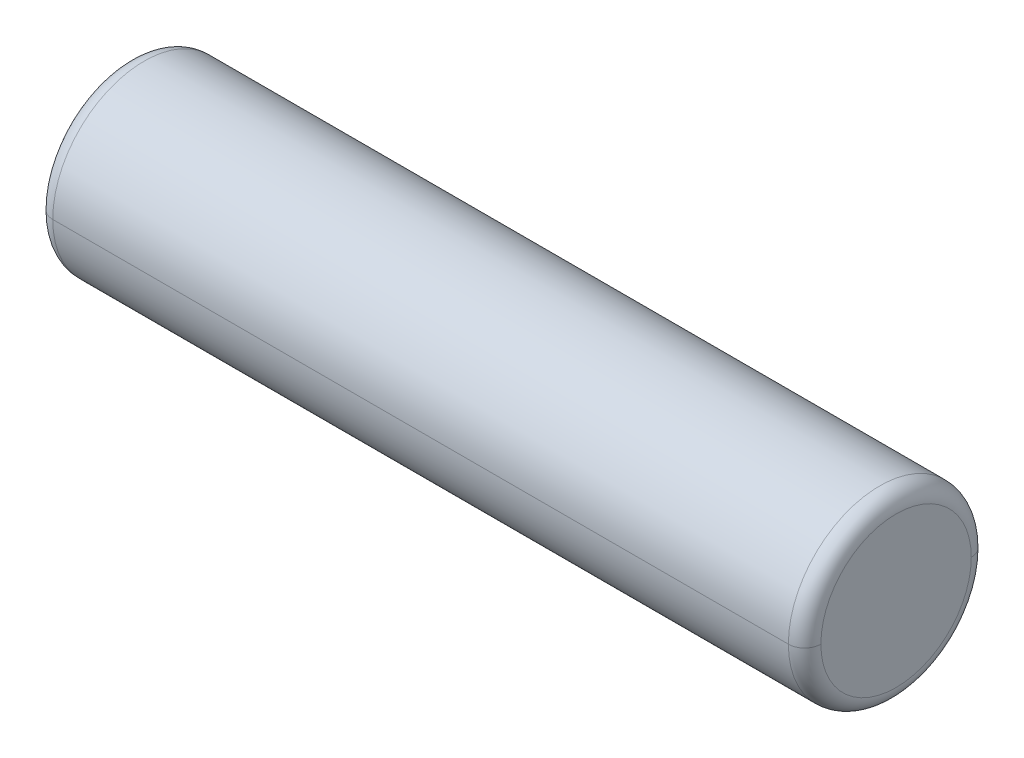
ISO-10303-21;
HEADER;
FILE_DESCRIPTION(('STEP AP214'),'2;1');
FILE_NAME('part.step','',(''),(''),'','','');
FILE_SCHEMA(('AUTOMOTIVE_DESIGN { 1 0 10303 214 1 1 1 1 }'));
ENDSEC;
DATA;
#1=APPLICATION_CONTEXT('core data for automotive mechanical design processes');
#2=APPLICATION_PROTOCOL_DEFINITION('international standard','automotive_design',2000,#1);
#3=PRODUCT_CONTEXT('',#1,'mechanical');
#4=PRODUCT('Part','Part','',(#3));
#5=PRODUCT_RELATED_PRODUCT_CATEGORY('part','',(#4));
#6=PRODUCT_DEFINITION_FORMATION('','',#4);
#7=PRODUCT_DEFINITION_CONTEXT('part definition',#1,'design');
#8=PRODUCT_DEFINITION('design','',#6,#7);
#9=PRODUCT_DEFINITION_SHAPE('','',#8);
#10=(LENGTH_UNIT() NAMED_UNIT(*) SI_UNIT(.MILLI.,.METRE.));
#11=(NAMED_UNIT(*) PLANE_ANGLE_UNIT() SI_UNIT($,.RADIAN.));
#12=(NAMED_UNIT(*) SI_UNIT($,.STERADIAN.) SOLID_ANGLE_UNIT());
#13=UNCERTAINTY_MEASURE_WITH_UNIT(LENGTH_MEASURE(1.E-05),#10,'distance_accuracy_value','');
#14=(GEOMETRIC_REPRESENTATION_CONTEXT(3) GLOBAL_UNCERTAINTY_ASSIGNED_CONTEXT((#13)) GLOBAL_UNIT_ASSIGNED_CONTEXT((#10,
#11,#12)) REPRESENTATION_CONTEXT('',''));
#15=CARTESIAN_POINT('',(0.,0.,0.));
#16=DIRECTION('',(0.,0.,1.));
#17=DIRECTION('',(1.,0.,0.));
#18=AXIS2_PLACEMENT_3D('',#15,#16,#17);
#19=CARTESIAN_POINT('',(8.01666666666676,6.75,0.));
#20=DIRECTION('',(1.,0.,0.));
#21=DIRECTION('',(0.,1.,0.));
#22=AXIS2_PLACEMENT_3D('',#19,#20,#21);
#23=TOROIDAL_SURFACE('',#22,0.6166666667,0.1333333333);
#24=CARTESIAN_POINT('',(8.0166666666667,6.75,0.));
#25=DIRECTION('',(1.,0.,0.));
#26=DIRECTION('',(0.,0.,-1.));
#27=AXIS2_PLACEMENT_3D('',#24,#25,#26);
#28=CIRCLE('',#27,0.75);
#29=CARTESIAN_POINT('',(8.0166666666667,6.75,0.75));
#30=VERTEX_POINT('',#29);
#31=CARTESIAN_POINT('',(8.0166666666667,6.75,-0.75));
#32=VERTEX_POINT('',#31);
#33=EDGE_CURVE('E11',#30,#32,#28,.T.);
#34=ORIENTED_EDGE('',*,*,#33,.T.);
#35=CARTESIAN_POINT('',(8.01666666666676,6.75,-0.75));
#36=CARTESIAN_POINT('',(8.01884833043433,6.75,-0.750000046278503));
#37=CARTESIAN_POINT('',(8.02102999026406,6.75,-0.7499464556167));
#38=CARTESIAN_POINT('',(8.02538805622017,6.75,-0.749732332704759));
#39=CARTESIAN_POINT('',(8.02756446234655,6.75,-0.749571800454621));
#40=CARTESIAN_POINT('',(8.03190677506832,6.75,-0.749144126658286));
#41=CARTESIAN_POINT('',(8.03407268166371,6.75,-0.748876985112089));
#42=CARTESIAN_POINT('',(8.03838877818146,6.75,-0.74823675087924));
#43=CARTESIAN_POINT('',(8.04053896810383,6.75,-0.747863658192588));
#44=CARTESIAN_POINT('',(8.04481845108765,6.75,-0.747012416582888));
#45=CARTESIAN_POINT('',(8.04694774414911,6.75,-0.746534267659839));
#46=CARTESIAN_POINT('',(8.05118030380908,6.75,-0.74547406652737));
#47=CARTESIAN_POINT('',(8.05328357040759,6.75,-0.744892014317949));
#48=CARTESIAN_POINT('',(8.05745901017443,6.75,-0.743625408546843));
#49=CARTESIAN_POINT('',(8.05953118334275,6.75,-0.742940854985158));
#50=CARTESIAN_POINT('',(8.06363944420623,6.75,-0.741470895734211));
#51=CARTESIAN_POINT('',(8.0656755319014,6.75,-0.74068549004495));
#52=CARTESIAN_POINT('',(8.06970671670397,6.75,-0.739015718629801));
#53=CARTESIAN_POINT('',(8.07170181381138,6.75,-0.738131352903913));
#54=CARTESIAN_POINT('',(8.07564621107504,6.75,-0.736265791935406));
#55=CARTESIAN_POINT('',(8.07759551123129,6.75,-0.735284596692785));
#56=CARTESIAN_POINT('',(8.08144361855773,6.75,-0.733227740474648));
#57=CARTESIAN_POINT('',(8.08334242572793,6.75,-0.732152079499131));
#58=CARTESIAN_POINT('',(8.08708497268951,6.75,-0.729908883177093));
#59=CARTESIAN_POINT('',(8.08892871248088,6.75,-0.728741347830574));
#60=CARTESIAN_POINT('',(8.09255668295416,6.75,-0.726317215461341));
#61=CARTESIAN_POINT('',(8.09434091363606,6.75,-0.725060618438628));
#62=CARTESIAN_POINT('',(8.0978455675224,6.75,-0.72246138996933));
#63=CARTESIAN_POINT('',(8.09956599072683,6.75,-0.721118758522745));
#64=CARTESIAN_POINT('',(8.10293888500804,6.75,-0.718350695722451));
#65=CARTESIAN_POINT('',(8.10459135608481,6.75,-0.716925264368741));
#66=CARTESIAN_POINT('',(8.10782436516314,6.75,-0.713995035743185));
#67=CARTESIAN_POINT('',(8.10940490316469,6.75,-0.712490238471337));
#68=CARTESIAN_POINT('',(8.1124902384381,6.75,-0.709404903197936));
#69=CARTESIAN_POINT('',(8.11399503570994,6.75,-0.707824365196382));
#70=CARTESIAN_POINT('',(8.1169252643355,6.75,-0.704591356118053));
#71=CARTESIAN_POINT('',(8.11835069568921,6.75,-0.702938885041278));
#72=CARTESIAN_POINT('',(8.1211187584895,6.75,-0.699565990760069));
#73=CARTESIAN_POINT('',(8.12246138993609,6.75,-0.697845567555635));
#74=CARTESIAN_POINT('',(8.12506061840539,6.75,-0.694340913669301));
#75=CARTESIAN_POINT('',(8.1263172154281,6.75,-0.6925566829874));
#76=CARTESIAN_POINT('',(8.12874134779733,6.75,-0.688928712514123));
#77=CARTESIAN_POINT('',(8.12990888314385,6.75,-0.687084972722746));
#78=CARTESIAN_POINT('',(8.13215207946589,6.75,-0.683342425761173));
#79=CARTESIAN_POINT('',(8.13322774044141,6.75,-0.681443618590976));
#80=CARTESIAN_POINT('',(8.13528459665955,6.75,-0.677595511264531));
#81=CARTESIAN_POINT('',(8.13626579190217,6.75,-0.675646211108283));
#82=CARTESIAN_POINT('',(8.13813135287067,6.75,-0.671701813844622));
#83=CARTESIAN_POINT('',(8.13901571859656,6.75,-0.66970671673721));
#84=CARTESIAN_POINT('',(8.14068549001171,6.75,-0.665675531934636));
#85=CARTESIAN_POINT('',(8.14147089570097,6.75,-0.663639444239475));
#86=CARTESIAN_POINT('',(8.14294085495192,6.75,-0.659531183375992));
#87=CARTESIAN_POINT('',(8.1436254085136,6.75,-0.65745901020767));
#88=CARTESIAN_POINT('',(8.14489201428471,6.75,-0.653283570440835));
#89=CARTESIAN_POINT('',(8.14547406649413,6.75,-0.651180303842322));
#90=CARTESIAN_POINT('',(8.1465342676266,6.75,-0.646947744182351));
#91=CARTESIAN_POINT('',(8.14701241654965,6.75,-0.644818451120893));
#92=CARTESIAN_POINT('',(8.14786365815935,6.75,-0.640538968137069));
#93=CARTESIAN_POINT('',(8.148236750846,6.75,-0.638388778214702));
#94=CARTESIAN_POINT('',(8.14887698507885,6.75,-0.634072681696947));
#95=CARTESIAN_POINT('',(8.14914412662505,6.75,-0.631906775101559));
#96=CARTESIAN_POINT('',(8.14957180042138,6.75,-0.62756446237979));
#97=CARTESIAN_POINT('',(8.14973233267152,6.75,-0.625388056253408));
#98=CARTESIAN_POINT('',(8.14994645558346,6.75,-0.6210299902973));
#99=CARTESIAN_POINT('',(8.15000004624526,6.75,-0.618848330467574));
#100=CARTESIAN_POINT('',(8.14999999996676,6.75,-0.6166666667));
#101=B_SPLINE_CURVE_WITH_KNOTS('',3,(#35,#36,#37,#38,#39,#40,#41,#42,#43,#44,#45,#46,#47,#48,
#49,#50,#51,#52,#53,#54,#55,#56,#57,#58,#59,#60,#61,#62,#63,#64,#65,#66,#67,#68,#69,#70,#71,#72,
#73,#74,#75,#76,#77,#78,#79,#80,#81,#82,#83,#84,#85,#86,#87,#88,#89,#90,#91,#92,#93,#94,#95,#96,
#97,#98,#99,#100),.UNSPECIFIED.,.F.,.F.,(4,2,2,2,2,2,2,2,2,2,2,2,2,2,2,2,2,2,2,2,2,2,2,2,2,2,2,
2,2,2,2,2,4),(0.,0.00654432760447297,0.013088655208947,0.0196329828134216,0.0261773104178951,
0.0327216380223694,0.0392659656268427,0.0458102932313174,0.0523546208357908,0.0588989484402645,
0.0654432760447384,0.0719876036492121,0.0785319312536868,0.0850762588581607,0.0916205864626338,
0.0981649140671076,0.104709241671581,0.111253569276055,0.117797896880529,0.124342224485003,
0.130886552089477,0.137430879693951,0.143975207298425,0.150519534902898,0.157063862507372,
0.163608190111846,0.17015251771632,0.176696845320794,0.183241172925268,0.189785500529742,
0.196329828134215,0.202874155738689,0.209418483343163),.UNSPECIFIED.);
#102=CARTESIAN_POINT('',(8.15,6.75,-0.6166666666667));
#103=VERTEX_POINT('',#102);
#104=EDGE_CURVE('E26',#32,#103,#101,.T.);
#105=ORIENTED_EDGE('',*,*,#104,.T.);
#106=CARTESIAN_POINT('',(8.15,6.75,0.));
#107=DIRECTION('',(1.,0.,0.));
#108=DIRECTION('',(0.,0.,-1.));
#109=AXIS2_PLACEMENT_3D('',#106,#107,#108);
#110=CIRCLE('',#109,0.6166666667);
#111=CARTESIAN_POINT('',(8.14999999996676,6.75,0.6166666667));
#112=VERTEX_POINT('',#111);
#113=EDGE_CURVE('E147',#112,#103,#110,.T.);
#114=ORIENTED_EDGE('',*,*,#113,.F.);
#115=CARTESIAN_POINT('',(8.0166666666667,6.75,0.75));
#116=CARTESIAN_POINT('',(8.01884833043427,6.75,0.750000046278504));
#117=CARTESIAN_POINT('',(8.021029990264,6.75,0.749946455616702));
#118=CARTESIAN_POINT('',(8.02538805622011,6.75,0.749732332704763));
#119=CARTESIAN_POINT('',(8.02756446234649,6.75,0.749571800454626));
#120=CARTESIAN_POINT('',(8.03190677506826,6.75,0.749144126658292));
#121=CARTESIAN_POINT('',(8.03407268166365,6.75,0.748876985112097));
#122=CARTESIAN_POINT('',(8.03838877818141,6.75,0.748236750879249));
#123=CARTESIAN_POINT('',(8.04053896810378,6.75,0.747863658192598));
#124=CARTESIAN_POINT('',(8.0448184510876,6.75,0.747012416582899));
#125=CARTESIAN_POINT('',(8.04694774414906,6.75,0.746534267659851));
#126=CARTESIAN_POINT('',(8.05118030380903,6.75,0.745474066527383));
#127=CARTESIAN_POINT('',(8.05328357040755,6.75,0.744892014317963));
#128=CARTESIAN_POINT('',(8.05745901017438,6.75,0.743625408546858));
#129=CARTESIAN_POINT('',(8.05953118334271,6.75,0.742940854985173));
#130=CARTESIAN_POINT('',(8.06363944420619,6.75,0.741470895734228));
#131=CARTESIAN_POINT('',(8.06567553190135,6.75,0.740685490044967));
#132=CARTESIAN_POINT('',(8.06970671670393,6.75,0.739015718629819));
#133=CARTESIAN_POINT('',(8.07170181381134,6.75,0.738131352903932));
#134=CARTESIAN_POINT('',(8.075646211075,6.75,0.736265791935424));
#135=CARTESIAN_POINT('',(8.07759551123125,6.75,0.735284596692805));
#136=CARTESIAN_POINT('',(8.0814436185577,6.75,0.733227740474668));
#137=CARTESIAN_POINT('',(8.0833424257279,6.75,0.732152079499151));
#138=CARTESIAN_POINT('',(8.08708497268947,6.75,0.729908883177114));
#139=CARTESIAN_POINT('',(8.08892871248085,6.75,0.728741347830594));
#140=CARTESIAN_POINT('',(8.09255668295413,6.75,0.726317215461362));
#141=CARTESIAN_POINT('',(8.09434091363603,6.75,0.725060618438649));
#142=CARTESIAN_POINT('',(8.09784556752237,6.75,0.722461389969352));
#143=CARTESIAN_POINT('',(8.0995659907268,6.75,0.721118758522767));
#144=CARTESIAN_POINT('',(8.10293888500801,6.75,0.718350695722472));
#145=CARTESIAN_POINT('',(8.10459135608479,6.75,0.716925264368763));
#146=CARTESIAN_POINT('',(8.10782436516312,6.75,0.713995035743206));
#147=CARTESIAN_POINT('',(8.10940490316467,6.75,0.712490238471358));
#148=CARTESIAN_POINT('',(8.11249023843808,6.75,0.709404903197957));
#149=CARTESIAN_POINT('',(8.11399503570992,6.75,0.707824365196403));
#150=CARTESIAN_POINT('',(8.11692526433548,6.75,0.704591356118073));
#151=CARTESIAN_POINT('',(8.11835069568919,6.75,0.702938885041298));
#152=CARTESIAN_POINT('',(8.12111875848949,6.75,0.699565990760089));
#153=CARTESIAN_POINT('',(8.12246138993608,6.75,0.697845567555655));
#154=CARTESIAN_POINT('',(8.12506061840537,6.75,0.69434091366932));
#155=CARTESIAN_POINT('',(8.12631721542809,6.75,0.692556682987419));
#156=CARTESIAN_POINT('',(8.12874134779732,6.75,0.688928712514141));
#157=CARTESIAN_POINT('',(8.12990888314384,6.75,0.687084972722765));
#158=CARTESIAN_POINT('',(8.13215207946588,6.75,0.68334242576119));
#159=CARTESIAN_POINT('',(8.1332277404414,6.75,0.681443618590993));
#160=CARTESIAN_POINT('',(8.13528459665954,6.75,0.677595511264547));
#161=CARTESIAN_POINT('',(8.13626579190216,6.75,0.675646211108299));
#162=CARTESIAN_POINT('',(8.13813135287067,6.75,0.671701813844637));
#163=CARTESIAN_POINT('',(8.13901571859656,6.75,0.669706716737224));
#164=CARTESIAN_POINT('',(8.14068549001171,6.75,0.665675531934649));
#165=CARTESIAN_POINT('',(8.14147089570097,6.75,0.663639444239488));
#166=CARTESIAN_POINT('',(8.14294085495191,6.75,0.659531183376004));
#167=CARTESIAN_POINT('',(8.1436254085136,6.75,0.657459010207681));
#168=CARTESIAN_POINT('',(8.14489201428471,6.75,0.653283570440845));
#169=CARTESIAN_POINT('',(8.14547406649413,6.75,0.651180303842331));
#170=CARTESIAN_POINT('',(8.1465342676266,6.75,0.646947744182359));
#171=CARTESIAN_POINT('',(8.14701241654965,6.75,0.644818451120901));
#172=CARTESIAN_POINT('',(8.14786365815935,6.75,0.640538968137076));
#173=CARTESIAN_POINT('',(8.148236750846,6.75,0.638388778214708));
#174=CARTESIAN_POINT('',(8.14887698507885,6.75,0.634072681696952));
#175=CARTESIAN_POINT('',(8.14914412662505,6.75,0.631906775101564));
#176=CARTESIAN_POINT('',(8.14957180042138,6.75,0.627564462379793));
#177=CARTESIAN_POINT('',(8.14973233267152,6.75,0.62538805625341));
#178=CARTESIAN_POINT('',(8.14994645558346,6.75,0.621029990297301));
#179=CARTESIAN_POINT('',(8.15000004624526,6.75,0.618848330467574));
#180=CARTESIAN_POINT('',(8.14999999996676,6.75,0.6166666667));
#181=B_SPLINE_CURVE_WITH_KNOTS('',3,(#115,#116,#117,#118,#119,#120,#121,#122,#123,#124,#125,
#126,#127,#128,#129,#130,#131,#132,#133,#134,#135,#136,#137,#138,#139,#140,#141,#142,#143,#144,
#145,#146,#147,#148,#149,#150,#151,#152,#153,#154,#155,#156,#157,#158,#159,#160,#161,#162,#163,
#164,#165,#166,#167,#168,#169,#170,#171,#172,#173,#174,#175,#176,#177,#178,#179,#180),
.UNSPECIFIED.,.F.,.F.,(4,2,2,2,2,2,2,2,2,2,2,2,2,2,2,2,2,2,2,2,2,2,2,2,2,2,2,2,2,2,2,2,4),(0.,
0.00654432760447636,0.013088655208952,0.0196329828134279,0.0261773104179028,0.0327216380223783,
0.0392659656268545,0.0458102932313303,0.0523546208358064,0.0588989484402812,0.0654432760447578,
0.0719876036492341,0.0785319312537085,0.0850762588581849,0.0916205864626606,0.0981649140671359,
0.104709241671612,0.111253569276088,0.117797896880564,0.124342224485039,0.130886552089515,
0.137430879693991,0.143975207298467,0.150519534902942,0.157063862507418,0.163608190111894,
0.170152517716369,0.176696845320845,0.183241172925321,0.189785500529797,0.196329828134272,
0.202874155738748,0.209418483343224),.UNSPECIFIED.);
#182=EDGE_CURVE('E135',#30,#112,#181,.T.);
#183=ORIENTED_EDGE('',*,*,#182,.F.);
#184=EDGE_LOOP('',(#34,#105,#114,#183));
#185=FACE_BOUND('',#184,.T.);
#186=ADVANCED_FACE('F17',(#185),#23,.T.);
#187=CARTESIAN_POINT('',(8.01666666666676,6.75,0.));
#188=DIRECTION('',(1.,0.,0.));
#189=DIRECTION('',(0.,-1.,0.));
#190=AXIS2_PLACEMENT_3D('',#187,#188,#189);
#191=TOROIDAL_SURFACE('',#190,0.6166666667,0.1333333333);
#192=CARTESIAN_POINT('',(8.15,6.75,0.));
#193=DIRECTION('',(1.,0.,0.));
#194=DIRECTION('',(0.,0.,-1.));
#195=AXIS2_PLACEMENT_3D('',#192,#193,#194);
#196=CIRCLE('',#195,0.6166666667);
#197=EDGE_CURVE('E132',#103,#112,#196,.T.);
#198=ORIENTED_EDGE('',*,*,#197,.F.);
#199=ORIENTED_EDGE('',*,*,#104,.F.);
#200=CARTESIAN_POINT('',(8.0166666666667,6.75,0.));
#201=DIRECTION('',(1.,0.,0.));
#202=DIRECTION('',(0.,0.,-1.));
#203=AXIS2_PLACEMENT_3D('',#200,#201,#202);
#204=CIRCLE('',#203,0.75);
#205=EDGE_CURVE('E97',#32,#30,#204,.T.);
#206=ORIENTED_EDGE('',*,*,#205,.T.);
#207=ORIENTED_EDGE('',*,*,#182,.T.);
#208=EDGE_LOOP('',(#198,#199,#206,#207));
#209=FACE_BOUND('',#208,.T.);
#210=ADVANCED_FACE('F105',(#209),#191,.T.);
#211=CARTESIAN_POINT('',(8.15,6.75,0.));
#212=DIRECTION('',(-1.,0.,0.));
#213=DIRECTION('',(0.,-1.,0.));
#214=AXIS2_PLACEMENT_3D('',#211,#212,#213);
#215=CYLINDRICAL_SURFACE('',#214,0.75);
#216=ORIENTED_EDGE('',*,*,#205,.F.);
#217=DIRECTION('',(-1.,0.,0.));
#218=VECTOR('',#217,1.);
#219=CARTESIAN_POINT('',(8.0166666666667,6.75,-0.75));
#220=LINE('',#219,#218);
#221=CARTESIAN_POINT('',(1.9833333333333,6.75,-0.75));
#222=VERTEX_POINT('',#221);
#223=EDGE_CURVE('E93',#32,#222,#220,.T.);
#224=ORIENTED_EDGE('',*,*,#223,.T.);
#225=CARTESIAN_POINT('',(1.9833333333333,6.75,0.));
#226=DIRECTION('',(1.,0.,0.));
#227=DIRECTION('',(0.,0.,-1.));
#228=AXIS2_PLACEMENT_3D('',#225,#226,#227);
#229=CIRCLE('',#228,0.75);
#230=CARTESIAN_POINT('',(1.9833333333333,6.75,0.75));
#231=VERTEX_POINT('',#230);
#232=EDGE_CURVE('E89',#222,#231,#229,.T.);
#233=ORIENTED_EDGE('',*,*,#232,.T.);
#234=DIRECTION('',(-1.,0.,0.));
#235=VECTOR('',#234,1.);
#236=CARTESIAN_POINT('',(8.0166666666667,6.75,0.75));
#237=LINE('',#236,#235);
#238=EDGE_CURVE('E79',#30,#231,#237,.T.);
#239=ORIENTED_EDGE('',*,*,#238,.F.);
#240=EDGE_LOOP('',(#216,#224,#233,#239));
#241=FACE_BOUND('',#240,.T.);
#242=ADVANCED_FACE('F114',(#241),#215,.T.);
#243=CARTESIAN_POINT('',(8.15,6.75,0.));
#244=DIRECTION('',(-1.,0.,0.));
#245=DIRECTION('',(0.,1.,0.));
#246=AXIS2_PLACEMENT_3D('',#243,#244,#245);
#247=CYLINDRICAL_SURFACE('',#246,0.75);
#248=CARTESIAN_POINT('',(1.9833333333333,6.75,0.));
#249=DIRECTION('',(1.,0.,0.));
#250=DIRECTION('',(0.,0.,-1.));
#251=AXIS2_PLACEMENT_3D('',#248,#249,#250);
#252=CIRCLE('',#251,0.75);
#253=EDGE_CURVE('E64',#231,#222,#252,.T.);
#254=ORIENTED_EDGE('',*,*,#253,.T.);
#255=ORIENTED_EDGE('',*,*,#223,.F.);
#256=ORIENTED_EDGE('',*,*,#33,.F.);
#257=ORIENTED_EDGE('',*,*,#238,.T.);
#258=EDGE_LOOP('',(#254,#255,#256,#257));
#259=FACE_BOUND('',#258,.T.);
#260=ADVANCED_FACE('F184',(#259),#247,.T.);
#261=CARTESIAN_POINT('',(1.98333333333324,6.75,0.));
#262=DIRECTION('',(1.,0.,0.));
#263=DIRECTION('',(0.,1.,0.));
#264=AXIS2_PLACEMENT_3D('',#261,#262,#263);
#265=TOROIDAL_SURFACE('',#264,0.6166666667,0.1333333333);
#266=CARTESIAN_POINT('',(1.85,6.75,0.));
#267=DIRECTION('',(1.,0.,0.));
#268=DIRECTION('',(0.,0.,-1.));
#269=AXIS2_PLACEMENT_3D('',#266,#267,#268);
#270=CIRCLE('',#269,0.6166666667);
#271=CARTESIAN_POINT('',(1.85000000003324,6.75,0.6166666667));
#272=VERTEX_POINT('',#271);
#273=CARTESIAN_POINT('',(1.85,6.75,-0.6166666666667));
#274=VERTEX_POINT('',#273);
#275=EDGE_CURVE('E61',#272,#274,#270,.T.);
#276=ORIENTED_EDGE('',*,*,#275,.T.);
#277=CARTESIAN_POINT('',(1.85000000003324,6.75,-0.6166666667));
#278=CARTESIAN_POINT('',(1.84999995375474,6.75,-0.618848330467573));
#279=CARTESIAN_POINT('',(1.85005354441654,6.75,-0.621029990297299));
#280=CARTESIAN_POINT('',(1.85026766732848,6.75,-0.625388056253407));
#281=CARTESIAN_POINT('',(1.85042819957862,6.75,-0.627564462379789));
#282=CARTESIAN_POINT('',(1.85085587337495,6.75,-0.631906775101558));
#283=CARTESIAN_POINT('',(1.85112301492115,6.75,-0.634072681696946));
#284=CARTESIAN_POINT('',(1.851763249154,6.75,-0.638388778214701));
#285=CARTESIAN_POINT('',(1.85213634184065,6.75,-0.640538968137068));
#286=CARTESIAN_POINT('',(1.85298758345035,6.75,-0.644818451120893));
#287=CARTESIAN_POINT('',(1.8534657323734,6.75,-0.64694774418235));
#288=CARTESIAN_POINT('',(1.85452593350587,6.75,-0.651180303842321));
#289=CARTESIAN_POINT('',(1.85510798571529,6.75,-0.653283570440834));
#290=CARTESIAN_POINT('',(1.8563745914864,6.75,-0.657459010207669));
#291=CARTESIAN_POINT('',(1.85705914504808,6.75,-0.659531183375991));
#292=CARTESIAN_POINT('',(1.85852910429903,6.75,-0.663639444239474));
#293=CARTESIAN_POINT('',(1.85931450998829,6.75,-0.665675531934635));
#294=CARTESIAN_POINT('',(1.86098428140344,6.75,-0.669706716737209));
#295=CARTESIAN_POINT('',(1.86186864712933,6.75,-0.671701813844622));
#296=CARTESIAN_POINT('',(1.86373420809783,6.75,-0.675646211108282));
#297=CARTESIAN_POINT('',(1.86471540334045,6.75,-0.67759551126453));
#298=CARTESIAN_POINT('',(1.86677225955859,6.75,-0.681443618590975));
#299=CARTESIAN_POINT('',(1.86784792053411,6.75,-0.683342425761172));
#300=CARTESIAN_POINT('',(1.87009111685615,6.75,-0.687084972722746));
#301=CARTESIAN_POINT('',(1.87125865220267,6.75,-0.688928712514122));
#302=CARTESIAN_POINT('',(1.8736827845719,6.75,-0.692556682987399));
#303=CARTESIAN_POINT('',(1.87493938159461,6.75,-0.6943409136693));
#304=CARTESIAN_POINT('',(1.87753861006391,6.75,-0.697845567555635));
#305=CARTESIAN_POINT('',(1.87888124151049,6.75,-0.699565990760068));
#306=CARTESIAN_POINT('',(1.88164930431079,6.75,-0.702938885041277));
#307=CARTESIAN_POINT('',(1.8830747356645,6.75,-0.704591356118052));
#308=CARTESIAN_POINT('',(1.88600496429006,6.75,-0.707824365196381));
#309=CARTESIAN_POINT('',(1.8875097615619,6.75,-0.709404903197935));
#310=CARTESIAN_POINT('',(1.8905950968353,6.75,-0.712490238471336));
#311=CARTESIAN_POINT('',(1.89217563483686,6.75,-0.713995035743184));
#312=CARTESIAN_POINT('',(1.89540864391519,6.75,-0.716925264368741));
#313=CARTESIAN_POINT('',(1.89706111499196,6.75,-0.71835069572245));
#314=CARTESIAN_POINT('',(1.90043400927317,6.75,-0.721118758522745));
#315=CARTESIAN_POINT('',(1.9021544324776,6.75,-0.72246138996933));
#316=CARTESIAN_POINT('',(1.90565908636394,6.75,-0.725060618438628));
#317=CARTESIAN_POINT('',(1.90744331704584,6.75,-0.72631721546134));
#318=CARTESIAN_POINT('',(1.91107128751912,6.75,-0.728741347830573));
#319=CARTESIAN_POINT('',(1.91291502731049,6.75,-0.729908883177093));
#320=CARTESIAN_POINT('',(1.91665757427207,6.75,-0.73215207949913));
#321=CARTESIAN_POINT('',(1.91855638144226,6.75,-0.733227740474648));
#322=CARTESIAN_POINT('',(1.92240448876871,6.75,-0.735284596692785));
#323=CARTESIAN_POINT('',(1.92435378892496,6.75,-0.736265791935405));
#324=CARTESIAN_POINT('',(1.92829818618862,6.75,-0.738131352903913));
#325=CARTESIAN_POINT('',(1.93029328329603,6.75,-0.739015718629801));
#326=CARTESIAN_POINT('',(1.9343244680986,6.75,-0.74068549004495));
#327=CARTESIAN_POINT('',(1.93636055579376,6.75,-0.741470895734211));
#328=CARTESIAN_POINT('',(1.94046881665725,6.75,-0.742940854985158));
#329=CARTESIAN_POINT('',(1.94254098982557,6.75,-0.743625408546843));
#330=CARTESIAN_POINT('',(1.9467164295924,6.75,-0.744892014317949));
#331=CARTESIAN_POINT('',(1.94881969619092,6.75,-0.74547406652737));
#332=CARTESIAN_POINT('',(1.95305225585089,6.75,-0.746534267659839));
#333=CARTESIAN_POINT('',(1.95518154891235,6.75,-0.747012416582887));
#334=CARTESIAN_POINT('',(1.95946103189617,6.75,-0.747863658192588));
#335=CARTESIAN_POINT('',(1.96161122181854,6.75,-0.74823675087924));
#336=CARTESIAN_POINT('',(1.96592731833629,6.75,-0.748876985112089));
#337=CARTESIAN_POINT('',(1.96809322493168,6.75,-0.749144126658286));
#338=CARTESIAN_POINT('',(1.97243553765345,6.75,-0.749571800454621));
#339=CARTESIAN_POINT('',(1.97461194377983,6.75,-0.749732332704759));
#340=CARTESIAN_POINT('',(1.97897000973594,6.75,-0.7499464556167));
#341=CARTESIAN_POINT('',(1.98115166956567,6.75,-0.750000046278503));
#342=CARTESIAN_POINT('',(1.98333333333324,6.75,-0.75));
#343=B_SPLINE_CURVE_WITH_KNOTS('',3,(#277,#278,#279,#280,#281,#282,#283,#284,#285,#286,#287,
#288,#289,#290,#291,#292,#293,#294,#295,#296,#297,#298,#299,#300,#301,#302,#303,#304,#305,#306,
#307,#308,#309,#310,#311,#312,#313,#314,#315,#316,#317,#318,#319,#320,#321,#322,#323,#324,#325,
#326,#327,#328,#329,#330,#331,#332,#333,#334,#335,#336,#337,#338,#339,#340,#341,#342),
.UNSPECIFIED.,.F.,.F.,(4,2,2,2,2,2,2,2,2,2,2,2,2,2,2,2,2,2,2,2,2,2,2,2,2,2,2,2,2,2,2,2,4),(0.,
0.00654432760447383,0.0130886552089477,0.0196329828134216,0.0261773104178954,0.0327216380223693,
0.0392659656268431,0.045810293231317,0.0523546208357909,0.0588989484402647,0.0654432760447385,
0.0719876036492123,0.0785319312536862,0.0850762588581601,0.0916205864626339,0.0981649140671079,
0.104709241671582,0.111253569276056,0.117797896880529,0.124342224485003,0.130886552089477,
0.137430879693951,0.143975207298425,0.150519534902899,0.157063862507373,0.163608190111846,
0.17015251771632,0.176696845320794,0.183241172925268,0.189785500529742,0.196329828134216,
0.20287415573869,0.209418483343164),.UNSPECIFIED.);
#344=EDGE_CURVE('E68',#274,#222,#343,.T.);
#345=ORIENTED_EDGE('',*,*,#344,.T.);
#346=ORIENTED_EDGE('',*,*,#253,.F.);
#347=CARTESIAN_POINT('',(1.85000000003324,6.75,0.6166666667));
#348=CARTESIAN_POINT('',(1.84999995375474,6.75,0.618848330467574));
#349=CARTESIAN_POINT('',(1.85005354441654,6.75,0.6210299902973));
#350=CARTESIAN_POINT('',(1.85026766732848,6.75,0.62538805625341));
#351=CARTESIAN_POINT('',(1.85042819957862,6.75,0.627564462379792));
#352=CARTESIAN_POINT('',(1.85085587337495,6.75,0.631906775101563));
#353=CARTESIAN_POINT('',(1.85112301492115,6.75,0.634072681696951));
#354=CARTESIAN_POINT('',(1.851763249154,6.75,0.638388778214707));
#355=CARTESIAN_POINT('',(1.85213634184065,6.75,0.640538968137075));
#356=CARTESIAN_POINT('',(1.85298758345035,6.75,0.644818451120901));
#357=CARTESIAN_POINT('',(1.8534657323734,6.75,0.646947744182359));
#358=CARTESIAN_POINT('',(1.85452593350587,6.75,0.651180303842331));
#359=CARTESIAN_POINT('',(1.85510798571529,6.75,0.653283570440845));
#360=CARTESIAN_POINT('',(1.8563745914864,6.75,0.657459010207681));
#361=CARTESIAN_POINT('',(1.85705914504809,6.75,0.659531183376003));
#362=CARTESIAN_POINT('',(1.85852910429903,6.75,0.663639444239487));
#363=CARTESIAN_POINT('',(1.8593145099883,6.75,0.665675531934649));
#364=CARTESIAN_POINT('',(1.86098428140344,6.75,0.669706716737224));
#365=CARTESIAN_POINT('',(1.86186864712933,6.75,0.671701813844637));
#366=CARTESIAN_POINT('',(1.86373420809784,6.75,0.675646211108298));
#367=CARTESIAN_POINT('',(1.86471540334046,6.75,0.677595511264547));
#368=CARTESIAN_POINT('',(1.8667722595586,6.75,0.681443618590992));
#369=CARTESIAN_POINT('',(1.86784792053412,6.75,0.68334242576119));
#370=CARTESIAN_POINT('',(1.87009111685616,6.75,0.687084972722764));
#371=CARTESIAN_POINT('',(1.87125865220268,6.75,0.688928712514141));
#372=CARTESIAN_POINT('',(1.87368278457191,6.75,0.692556682987419));
#373=CARTESIAN_POINT('',(1.87493938159463,6.75,0.69434091366932));
#374=CARTESIAN_POINT('',(1.87753861006392,6.75,0.697845567555655));
#375=CARTESIAN_POINT('',(1.87888124151051,6.75,0.699565990760088));
#376=CARTESIAN_POINT('',(1.88164930431081,6.75,0.702938885041298));
#377=CARTESIAN_POINT('',(1.88307473566452,6.75,0.704591356118073));
#378=CARTESIAN_POINT('',(1.88600496429008,6.75,0.707824365196402));
#379=CARTESIAN_POINT('',(1.88750976156192,6.75,0.709404903197956));
#380=CARTESIAN_POINT('',(1.89059509683533,6.75,0.712490238471358));
#381=CARTESIAN_POINT('',(1.89217563483688,6.75,0.713995035743206));
#382=CARTESIAN_POINT('',(1.89540864391521,6.75,0.716925264368763));
#383=CARTESIAN_POINT('',(1.89706111499199,6.75,0.718350695722472));
#384=CARTESIAN_POINT('',(1.9004340092732,6.75,0.721118758522766));
#385=CARTESIAN_POINT('',(1.90215443247763,6.75,0.722461389969351));
#386=CARTESIAN_POINT('',(1.90565908636397,6.75,0.725060618438649));
#387=CARTESIAN_POINT('',(1.90744331704587,6.75,0.726317215461362));
#388=CARTESIAN_POINT('',(1.91107128751915,6.75,0.728741347830594));
#389=CARTESIAN_POINT('',(1.91291502731053,6.75,0.729908883177114));
#390=CARTESIAN_POINT('',(1.9166575742721,6.75,0.73215207949915));
#391=CARTESIAN_POINT('',(1.9185563814423,6.75,0.733227740474668));
#392=CARTESIAN_POINT('',(1.92240448876875,6.75,0.735284596692804));
#393=CARTESIAN_POINT('',(1.92435378892499,6.75,0.736265791935424));
#394=CARTESIAN_POINT('',(1.92829818618866,6.75,0.738131352903931));
#395=CARTESIAN_POINT('',(1.93029328329607,6.75,0.739015718629819));
#396=CARTESIAN_POINT('',(1.93432446809865,6.75,0.740685490044967));
#397=CARTESIAN_POINT('',(1.93636055579381,6.75,0.741470895734228));
#398=CARTESIAN_POINT('',(1.94046881665729,6.75,0.742940854985173));
#399=CARTESIAN_POINT('',(1.94254098982562,6.75,0.743625408546858));
#400=CARTESIAN_POINT('',(1.94671642959245,6.75,0.744892014317963));
#401=CARTESIAN_POINT('',(1.94881969619097,6.75,0.745474066527383));
#402=CARTESIAN_POINT('',(1.95305225585094,6.75,0.746534267659851));
#403=CARTESIAN_POINT('',(1.9551815489124,6.75,0.747012416582899));
#404=CARTESIAN_POINT('',(1.95946103189622,6.75,0.747863658192598));
#405=CARTESIAN_POINT('',(1.96161122181859,6.75,0.748236750879249));
#406=CARTESIAN_POINT('',(1.96592731833635,6.75,0.748876985112096));
#407=CARTESIAN_POINT('',(1.96809322493174,6.75,0.749144126658292));
#408=CARTESIAN_POINT('',(1.97243553765351,6.75,0.749571800454626));
#409=CARTESIAN_POINT('',(1.97461194377989,6.75,0.749732332704763));
#410=CARTESIAN_POINT('',(1.978970009736,6.75,0.749946455616702));
#411=CARTESIAN_POINT('',(1.98115166956573,6.75,0.750000046278504));
#412=CARTESIAN_POINT('',(1.9833333333333,6.75,0.75));
#413=B_SPLINE_CURVE_WITH_KNOTS('',3,(#347,#348,#349,#350,#351,#352,#353,#354,#355,#356,#357,
#358,#359,#360,#361,#362,#363,#364,#365,#366,#367,#368,#369,#370,#371,#372,#373,#374,#375,#376,
#377,#378,#379,#380,#381,#382,#383,#384,#385,#386,#387,#388,#389,#390,#391,#392,#393,#394,#395,
#396,#397,#398,#399,#400,#401,#402,#403,#404,#405,#406,#407,#408,#409,#410,#411,#412),
.UNSPECIFIED.,.F.,.F.,(4,2,2,2,2,2,2,2,2,2,2,2,2,2,2,2,2,2,2,2,2,2,2,2,2,2,2,2,2,2,2,2,4),(0.,
0.00654432760447579,0.0130886552089515,0.0196329828134272,0.026177310417903,0.0327216380223787,
0.0392659656268545,0.0458102932313301,0.0523546208358059,0.0588989484402816,0.0654432760447573,
0.0719876036492331,0.0785319312537088,0.0850762588581845,0.0916205864626602,0.0981649140671361,
0.104709241671612,0.111253569276087,0.117797896880563,0.124342224485039,0.130886552089515,
0.13743087969399,0.143975207298466,0.150519534902942,0.157063862507418,0.163608190111893,
0.170152517716369,0.176696845320845,0.18324117292532,0.189785500529796,0.196329828134272,
0.202874155738748,0.209418483343224),.UNSPECIFIED.);
#414=EDGE_CURVE('E55',#272,#231,#413,.T.);
#415=ORIENTED_EDGE('',*,*,#414,.F.);
#416=EDGE_LOOP('',(#276,#345,#346,#415));
#417=FACE_BOUND('',#416,.T.);
#418=ADVANCED_FACE('F58',(#417),#265,.T.);
#419=CARTESIAN_POINT('',(1.98333333333324,6.75,0.));
#420=DIRECTION('',(1.,0.,0.));
#421=DIRECTION('',(0.,-1.,0.));
#422=AXIS2_PLACEMENT_3D('',#419,#420,#421);
#423=TOROIDAL_SURFACE('',#422,0.6166666667,0.1333333333);
#424=ORIENTED_EDGE('',*,*,#232,.F.);
#425=ORIENTED_EDGE('',*,*,#344,.F.);
#426=CARTESIAN_POINT('',(1.85,6.75,0.));
#427=DIRECTION('',(1.,0.,0.));
#428=DIRECTION('',(0.,0.,-1.));
#429=AXIS2_PLACEMENT_3D('',#426,#427,#428);
#430=CIRCLE('',#429,0.6166666667);
#431=EDGE_CURVE('E69',#274,#272,#430,.T.);
#432=ORIENTED_EDGE('',*,*,#431,.T.);
#433=ORIENTED_EDGE('',*,*,#414,.T.);
#434=EDGE_LOOP('',(#424,#425,#432,#433));
#435=FACE_BOUND('',#434,.T.);
#436=ADVANCED_FACE('F73',(#435),#423,.T.);
#437=CARTESIAN_POINT('',(1.85,6.75,0.));
#438=DIRECTION('',(1.,0.,0.));
#439=DIRECTION('',(0.,0.,-1.));
#440=AXIS2_PLACEMENT_3D('',#437,#438,#439);
#441=PLANE('',#440);
#442=ORIENTED_EDGE('',*,*,#431,.F.);
#443=ORIENTED_EDGE('',*,*,#275,.F.);
#444=EDGE_LOOP('',(#442,#443));
#445=FACE_BOUND('',#444,.T.);
#446=ADVANCED_FACE('F77',(#445),#441,.F.);
#447=CARTESIAN_POINT('',(8.15,7.3666666666667,0.));
#448=DIRECTION('',(-1.,0.,0.));
#449=DIRECTION('',(0.,0.,1.));
#450=AXIS2_PLACEMENT_3D('',#447,#448,#449);
#451=PLANE('',#450);
#452=ORIENTED_EDGE('',*,*,#197,.T.);
#453=ORIENTED_EDGE('',*,*,#113,.T.);
#454=EDGE_LOOP('',(#452,#453));
#455=FACE_BOUND('',#454,.T.);
#456=ADVANCED_FACE('F161',(#455),#451,.F.);
#457=CLOSED_SHELL('',(#186,#210,#242,#260,#418,#436,#446,#456));
#458=MANIFOLD_SOLID_BREP('B1',#457);
#459=ADVANCED_BREP_SHAPE_REPRESENTATION('',(#18,#458),#14);
#460=SHAPE_DEFINITION_REPRESENTATION(#9,#459);
ENDSEC;
END-ISO-10303-21;
